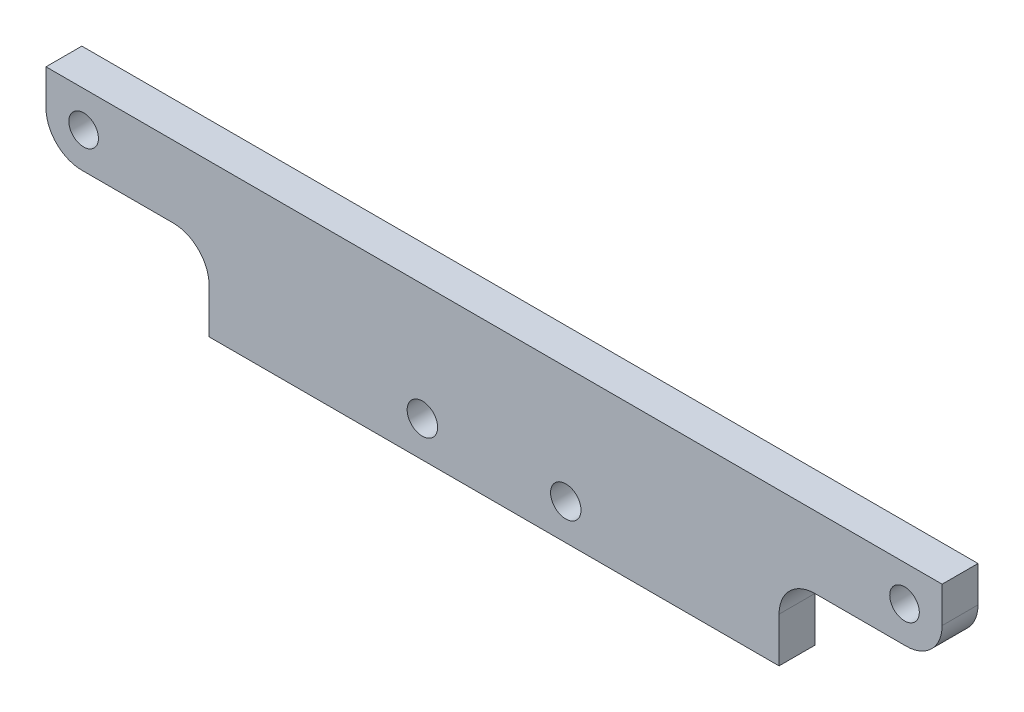
ISO-10303-21;
HEADER;
FILE_DESCRIPTION(('STEP AP214'),'2;1');
FILE_NAME('part.step','',(''),(''),'','','');
FILE_SCHEMA(('AUTOMOTIVE_DESIGN { 1 0 10303 214 1 1 1 1 }'));
ENDSEC;
DATA;
#1=APPLICATION_CONTEXT('core data for automotive mechanical design processes');
#2=APPLICATION_PROTOCOL_DEFINITION('international standard','automotive_design',2000,#1);
#3=PRODUCT_CONTEXT('',#1,'mechanical');
#4=PRODUCT('Part','Part','',(#3));
#5=PRODUCT_RELATED_PRODUCT_CATEGORY('part','',(#4));
#6=PRODUCT_DEFINITION_FORMATION('','',#4);
#7=PRODUCT_DEFINITION_CONTEXT('part definition',#1,'design');
#8=PRODUCT_DEFINITION('design','',#6,#7);
#9=PRODUCT_DEFINITION_SHAPE('','',#8);
#10=(LENGTH_UNIT() NAMED_UNIT(*) SI_UNIT(.MILLI.,.METRE.));
#11=(NAMED_UNIT(*) PLANE_ANGLE_UNIT() SI_UNIT($,.RADIAN.));
#12=(NAMED_UNIT(*) SI_UNIT($,.STERADIAN.) SOLID_ANGLE_UNIT());
#13=UNCERTAINTY_MEASURE_WITH_UNIT(LENGTH_MEASURE(1.E-05),#10,'distance_accuracy_value','');
#14=(GEOMETRIC_REPRESENTATION_CONTEXT(3) GLOBAL_UNCERTAINTY_ASSIGNED_CONTEXT((#13)) GLOBAL_UNIT_ASSIGNED_CONTEXT((#10,
#11,#12)) REPRESENTATION_CONTEXT('',''));
#15=CARTESIAN_POINT('',(0.,0.,0.));
#16=DIRECTION('',(0.,0.,1.));
#17=DIRECTION('',(1.,0.,0.));
#18=AXIS2_PLACEMENT_3D('',#15,#16,#17);
#19=CARTESIAN_POINT('',(-50.,0.,2.));
#20=DIRECTION('',(1.,0.,0.));
#21=DIRECTION('',(0.,0.,-1.));
#22=AXIS2_PLACEMENT_3D('',#19,#20,#21);
#23=PLANE('',#22);
#24=DIRECTION('',(0.,-1.,0.));
#25=VECTOR('',#24,1.);
#26=CARTESIAN_POINT('',(-50.,0.,-2.));
#27=LINE('',#26,#25);
#28=CARTESIAN_POINT('',(-50.,17.,-2.));
#29=VERTEX_POINT('',#28);
#30=CARTESIAN_POINT('',(-50.,13.,-2.));
#31=VERTEX_POINT('',#30);
#32=EDGE_CURVE('E153',#29,#31,#27,.T.);
#33=ORIENTED_EDGE('',*,*,#32,.T.);
#34=DIRECTION('',(0.,0.,-1.));
#35=VECTOR('',#34,1.);
#36=CARTESIAN_POINT('',(-50.,13.,2.));
#37=LINE('',#36,#35);
#38=CARTESIAN_POINT('',(-50.,13.,2.));
#39=VERTEX_POINT('',#38);
#40=EDGE_CURVE('E180',#31,#39,#37,.F.);
#41=ORIENTED_EDGE('',*,*,#40,.T.);
#42=DIRECTION('',(0.,-1.,0.));
#43=VECTOR('',#42,1.);
#44=CARTESIAN_POINT('',(-50.,0.,2.));
#45=LINE('',#44,#43);
#46=CARTESIAN_POINT('',(-50.,17.,2.));
#47=VERTEX_POINT('',#46);
#48=EDGE_CURVE('E163',#47,#39,#45,.T.);
#49=ORIENTED_EDGE('',*,*,#48,.F.);
#50=DIRECTION('',(0.,0.,-1.));
#51=VECTOR('',#50,1.);
#52=CARTESIAN_POINT('',(-50.,17.,2.));
#53=LINE('',#52,#51);
#54=EDGE_CURVE('E164',#47,#29,#53,.T.);
#55=ORIENTED_EDGE('',*,*,#54,.T.);
#56=EDGE_LOOP('',(#33,#41,#49,#55));
#57=FACE_BOUND('',#56,.T.);
#58=ADVANCED_FACE('F36',(#57),#23,.F.);
#59=CARTESIAN_POINT('',(50.,0.,2.));
#60=DIRECTION('',(0.,1.,0.));
#61=DIRECTION('',(-1.,0.,0.));
#62=AXIS2_PLACEMENT_3D('',#59,#60,#61);
#63=PLANE('',#62);
#64=DIRECTION('',(1.,0.,0.));
#65=VECTOR('',#64,1.);
#66=CARTESIAN_POINT('',(50.,0.,-2.));
#67=LINE('',#66,#65);
#68=CARTESIAN_POINT('',(-31.8,0.,-2.));
#69=VERTEX_POINT('',#68);
#70=CARTESIAN_POINT('',(31.8,0.,-2.));
#71=VERTEX_POINT('',#70);
#72=EDGE_CURVE('E145',#69,#71,#67,.T.);
#73=ORIENTED_EDGE('',*,*,#72,.T.);
#74=DIRECTION('',(0.,0.,-1.));
#75=VECTOR('',#74,1.);
#76=CARTESIAN_POINT('',(31.8,0.,8.));
#77=LINE('',#76,#75);
#78=CARTESIAN_POINT('',(31.8,0.,2.));
#79=VERTEX_POINT('',#78);
#80=EDGE_CURVE('E126',#79,#71,#77,.T.);
#81=ORIENTED_EDGE('',*,*,#80,.F.);
#82=DIRECTION('',(1.,0.,0.));
#83=VECTOR('',#82,1.);
#84=CARTESIAN_POINT('',(50.,0.,2.));
#85=LINE('',#84,#83);
#86=CARTESIAN_POINT('',(-31.8,0.,2.));
#87=VERTEX_POINT('',#86);
#88=EDGE_CURVE('E246',#87,#79,#85,.T.);
#89=ORIENTED_EDGE('',*,*,#88,.F.);
#90=DIRECTION('',(0.,0.,-1.));
#91=VECTOR('',#90,1.);
#92=CARTESIAN_POINT('',(-31.8,0.,8.));
#93=LINE('',#92,#91);
#94=EDGE_CURVE('E151',#87,#69,#93,.T.);
#95=ORIENTED_EDGE('',*,*,#94,.T.);
#96=EDGE_LOOP('',(#73,#81,#89,#95));
#97=FACE_BOUND('',#96,.T.);
#98=ADVANCED_FACE('F150',(#97),#63,.F.);
#99=CARTESIAN_POINT('',(0.,0.,2.));
#100=DIRECTION('',(0.,0.,-1.));
#101=DIRECTION('',(-1.,0.,0.));
#102=AXIS2_PLACEMENT_3D('',#99,#100,#101);
#103=PLANE('',#102);
#104=CARTESIAN_POINT('',(8.,3.99999999999999,2.));
#105=DIRECTION('',(0.,0.,-1.));
#106=DIRECTION('',(-1.,0.,0.));
#107=AXIS2_PLACEMENT_3D('',#104,#105,#106);
#108=CIRCLE('',#107,1.7);
#109=CARTESIAN_POINT('',(6.3,3.99999999999999,2.));
#110=VERTEX_POINT('',#109);
#111=EDGE_CURVE('E158',#110,#110,#108,.T.);
#112=ORIENTED_EDGE('',*,*,#111,.T.);
#113=EDGE_LOOP('',(#112));
#114=FACE_BOUND('',#113,.T.);
#115=CARTESIAN_POINT('',(-8.,3.99999999999999,2.));
#116=DIRECTION('',(0.,0.,-1.));
#117=DIRECTION('',(-1.,0.,0.));
#118=AXIS2_PLACEMENT_3D('',#115,#116,#117);
#119=CIRCLE('',#118,1.7);
#120=CARTESIAN_POINT('',(-9.7,3.99999999999999,2.));
#121=VERTEX_POINT('',#120);
#122=EDGE_CURVE('E236',#121,#121,#119,.T.);
#123=ORIENTED_EDGE('',*,*,#122,.T.);
#124=EDGE_LOOP('',(#123));
#125=FACE_BOUND('',#124,.T.);
#126=CARTESIAN_POINT('',(-45.8,13.,2.));
#127=DIRECTION('',(0.,0.,-1.));
#128=DIRECTION('',(-1.,0.,0.));
#129=AXIS2_PLACEMENT_3D('',#126,#127,#128);
#130=CIRCLE('',#129,1.65);
#131=CARTESIAN_POINT('',(-47.45,13.,2.));
#132=VERTEX_POINT('',#131);
#133=EDGE_CURVE('E230',#132,#132,#130,.T.);
#134=ORIENTED_EDGE('',*,*,#133,.T.);
#135=EDGE_LOOP('',(#134));
#136=FACE_BOUND('',#135,.T.);
#137=CARTESIAN_POINT('',(45.8,13.,2.));
#138=DIRECTION('',(0.,0.,-1.));
#139=DIRECTION('',(-1.,0.,0.));
#140=AXIS2_PLACEMENT_3D('',#137,#138,#139);
#141=CIRCLE('',#140,1.65);
#142=CARTESIAN_POINT('',(44.15,13.,2.));
#143=VERTEX_POINT('',#142);
#144=EDGE_CURVE('E224',#143,#143,#141,.T.);
#145=ORIENTED_EDGE('',*,*,#144,.T.);
#146=EDGE_LOOP('',(#145));
#147=FACE_BOUND('',#146,.T.);
#148=ORIENTED_EDGE('',*,*,#48,.T.);
#149=CARTESIAN_POINT('',(-46.,13.,2.));
#150=DIRECTION('',(0.,0.,-1.));
#151=DIRECTION('',(-1.,0.,0.));
#152=AXIS2_PLACEMENT_3D('',#149,#150,#151);
#153=CIRCLE('',#152,4.);
#154=CARTESIAN_POINT('',(-46.,9.00000000000003,2.));
#155=VERTEX_POINT('',#154);
#156=EDGE_CURVE('E183',#39,#155,#153,.F.);
#157=ORIENTED_EDGE('',*,*,#156,.T.);
#158=DIRECTION('',(-1.,0.,0.));
#159=VECTOR('',#158,1.);
#160=CARTESIAN_POINT('',(0.,9.00000000000002,2.));
#161=LINE('',#160,#159);
#162=CARTESIAN_POINT('',(-35.8,9.00000000000003,2.));
#163=VERTEX_POINT('',#162);
#164=EDGE_CURVE('E215',#163,#155,#161,.T.);
#165=ORIENTED_EDGE('',*,*,#164,.F.);
#166=CARTESIAN_POINT('',(-35.8,5.00000000000003,2.));
#167=DIRECTION('',(0.,0.,-1.));
#168=DIRECTION('',(-1.,0.,0.));
#169=AXIS2_PLACEMENT_3D('',#166,#167,#168);
#170=CIRCLE('',#169,4.);
#171=CARTESIAN_POINT('',(-31.8,5.00000000000003,2.));
#172=VERTEX_POINT('',#171);
#173=EDGE_CURVE('E51',#163,#172,#170,.T.);
#174=ORIENTED_EDGE('',*,*,#173,.T.);
#175=DIRECTION('',(0.,1.,0.));
#176=VECTOR('',#175,1.);
#177=CARTESIAN_POINT('',(-31.8,0.,2.));
#178=LINE('',#177,#176);
#179=EDGE_CURVE('E214',#87,#172,#178,.T.);
#180=ORIENTED_EDGE('',*,*,#179,.F.);
#181=ORIENTED_EDGE('',*,*,#88,.T.);
#182=DIRECTION('',(0.,1.,0.));
#183=VECTOR('',#182,1.);
#184=CARTESIAN_POINT('',(31.8,0.,2.));
#185=LINE('',#184,#183);
#186=CARTESIAN_POINT('',(31.8,5.00000000000002,2.));
#187=VERTEX_POINT('',#186);
#188=EDGE_CURVE('E132',#79,#187,#185,.T.);
#189=ORIENTED_EDGE('',*,*,#188,.T.);
#190=CARTESIAN_POINT('',(35.8,5.00000000000002,2.));
#191=DIRECTION('',(0.,0.,-1.));
#192=DIRECTION('',(-1.,0.,0.));
#193=AXIS2_PLACEMENT_3D('',#190,#191,#192);
#194=CIRCLE('',#193,4.);
#195=CARTESIAN_POINT('',(35.8,9.00000000000002,2.));
#196=VERTEX_POINT('',#195);
#197=EDGE_CURVE('E11',#187,#196,#194,.T.);
#198=ORIENTED_EDGE('',*,*,#197,.T.);
#199=DIRECTION('',(1.,0.,0.));
#200=VECTOR('',#199,1.);
#201=CARTESIAN_POINT('',(0.,9.00000000000002,2.));
#202=LINE('',#201,#200);
#203=CARTESIAN_POINT('',(46.,9.00000000000002,2.));
#204=VERTEX_POINT('',#203);
#205=EDGE_CURVE('E147',#196,#204,#202,.T.);
#206=ORIENTED_EDGE('',*,*,#205,.T.);
#207=CARTESIAN_POINT('',(46.,13.,2.));
#208=DIRECTION('',(0.,0.,-1.));
#209=DIRECTION('',(-1.,0.,0.));
#210=AXIS2_PLACEMENT_3D('',#207,#208,#209);
#211=CIRCLE('',#210,4.);
#212=CARTESIAN_POINT('',(50.,13.,2.));
#213=VERTEX_POINT('',#212);
#214=EDGE_CURVE('E58',#204,#213,#211,.F.);
#215=ORIENTED_EDGE('',*,*,#214,.T.);
#216=DIRECTION('',(0.,1.,0.));
#217=VECTOR('',#216,1.);
#218=CARTESIAN_POINT('',(50.,17.,2.));
#219=LINE('',#218,#217);
#220=CARTESIAN_POINT('',(50.,17.,2.));
#221=VERTEX_POINT('',#220);
#222=EDGE_CURVE('E248',#213,#221,#219,.T.);
#223=ORIENTED_EDGE('',*,*,#222,.T.);
#224=DIRECTION('',(-1.,0.,0.));
#225=VECTOR('',#224,1.);
#226=CARTESIAN_POINT('',(-50.,17.,2.));
#227=LINE('',#226,#225);
#228=EDGE_CURVE('E168',#221,#47,#227,.T.);
#229=ORIENTED_EDGE('',*,*,#228,.T.);
#230=EDGE_LOOP('',(#148,#157,#165,#174,#180,#181,#189,#198,#206,#215,#223,#229));
#231=FACE_BOUND('',#230,.T.);
#232=ADVANCED_FACE('F251',(#114,#125,#136,#147,#231),#103,.F.);
#233=CARTESIAN_POINT('',(0.,0.,-2.));
#234=DIRECTION('',(0.,0.,-1.));
#235=DIRECTION('',(-1.,0.,0.));
#236=AXIS2_PLACEMENT_3D('',#233,#234,#235);
#237=PLANE('',#236);
#238=DIRECTION('',(-1.,0.,0.));
#239=VECTOR('',#238,1.);
#240=CARTESIAN_POINT('',(0.,9.00000000000002,-2.));
#241=LINE('',#240,#239);
#242=CARTESIAN_POINT('',(-35.8,9.00000000000003,-2.));
#243=VERTEX_POINT('',#242);
#244=CARTESIAN_POINT('',(-46.,9.00000000000003,-2.));
#245=VERTEX_POINT('',#244);
#246=EDGE_CURVE('E201',#243,#245,#241,.T.);
#247=ORIENTED_EDGE('',*,*,#246,.T.);
#248=CARTESIAN_POINT('',(-46.,13.,-2.));
#249=DIRECTION('',(0.,0.,-1.));
#250=DIRECTION('',(-1.,0.,0.));
#251=AXIS2_PLACEMENT_3D('',#248,#249,#250);
#252=CIRCLE('',#251,4.);
#253=EDGE_CURVE('E178',#245,#31,#252,.T.);
#254=ORIENTED_EDGE('',*,*,#253,.T.);
#255=ORIENTED_EDGE('',*,*,#32,.F.);
#256=DIRECTION('',(-1.,0.,0.));
#257=VECTOR('',#256,1.);
#258=CARTESIAN_POINT('',(-50.,17.,-2.));
#259=LINE('',#258,#257);
#260=CARTESIAN_POINT('',(50.,17.,-2.));
#261=VERTEX_POINT('',#260);
#262=EDGE_CURVE('E155',#261,#29,#259,.T.);
#263=ORIENTED_EDGE('',*,*,#262,.F.);
#264=DIRECTION('',(0.,1.,0.));
#265=VECTOR('',#264,1.);
#266=CARTESIAN_POINT('',(50.,17.,-2.));
#267=LINE('',#266,#265);
#268=CARTESIAN_POINT('',(50.,13.,-2.));
#269=VERTEX_POINT('',#268);
#270=EDGE_CURVE('E152',#269,#261,#267,.T.);
#271=ORIENTED_EDGE('',*,*,#270,.F.);
#272=CARTESIAN_POINT('',(46.,13.,-2.));
#273=DIRECTION('',(0.,0.,-1.));
#274=DIRECTION('',(-1.,0.,0.));
#275=AXIS2_PLACEMENT_3D('',#272,#273,#274);
#276=CIRCLE('',#275,4.);
#277=CARTESIAN_POINT('',(46.,9.00000000000002,-2.));
#278=VERTEX_POINT('',#277);
#279=EDGE_CURVE('E176',#269,#278,#276,.T.);
#280=ORIENTED_EDGE('',*,*,#279,.T.);
#281=DIRECTION('',(1.,0.,0.));
#282=VECTOR('',#281,1.);
#283=CARTESIAN_POINT('',(31.8,9.00000000000002,-2.));
#284=LINE('',#283,#282);
#285=CARTESIAN_POINT('',(35.8,9.00000000000002,-2.));
#286=VERTEX_POINT('',#285);
#287=EDGE_CURVE('E137',#286,#278,#284,.T.);
#288=ORIENTED_EDGE('',*,*,#287,.F.);
#289=CARTESIAN_POINT('',(35.8,5.00000000000002,-2.));
#290=DIRECTION('',(0.,0.,-1.));
#291=DIRECTION('',(-1.,0.,0.));
#292=AXIS2_PLACEMENT_3D('',#289,#290,#291);
#293=CIRCLE('',#292,4.);
#294=CARTESIAN_POINT('',(31.8,5.00000000000002,-2.));
#295=VERTEX_POINT('',#294);
#296=EDGE_CURVE('E44',#286,#295,#293,.F.);
#297=ORIENTED_EDGE('',*,*,#296,.T.);
#298=DIRECTION('',(0.,1.,0.));
#299=VECTOR('',#298,1.);
#300=CARTESIAN_POINT('',(31.8,0.,-2.));
#301=LINE('',#300,#299);
#302=EDGE_CURVE('E129',#71,#295,#301,.T.);
#303=ORIENTED_EDGE('',*,*,#302,.F.);
#304=ORIENTED_EDGE('',*,*,#72,.F.);
#305=DIRECTION('',(0.,1.,0.));
#306=VECTOR('',#305,1.);
#307=CARTESIAN_POINT('',(-31.8,0.,-2.));
#308=LINE('',#307,#306);
#309=CARTESIAN_POINT('',(-31.8,5.00000000000003,-2.));
#310=VERTEX_POINT('',#309);
#311=EDGE_CURVE('E202',#69,#310,#308,.T.);
#312=ORIENTED_EDGE('',*,*,#311,.T.);
#313=CARTESIAN_POINT('',(-35.8,5.00000000000003,-2.));
#314=DIRECTION('',(0.,0.,-1.));
#315=DIRECTION('',(-1.,0.,0.));
#316=AXIS2_PLACEMENT_3D('',#313,#314,#315);
#317=CIRCLE('',#316,4.);
#318=EDGE_CURVE('E198',#310,#243,#317,.F.);
#319=ORIENTED_EDGE('',*,*,#318,.T.);
#320=EDGE_LOOP('',(#247,#254,#255,#263,#271,#280,#288,#297,#303,#304,#312,#319));
#321=FACE_BOUND('',#320,.T.);
#322=CARTESIAN_POINT('',(45.8,13.,-2.));
#323=DIRECTION('',(0.,0.,-1.));
#324=DIRECTION('',(-1.,0.,0.));
#325=AXIS2_PLACEMENT_3D('',#322,#323,#324);
#326=CIRCLE('',#325,1.65);
#327=CARTESIAN_POINT('',(44.15,13.,-2.));
#328=VERTEX_POINT('',#327);
#329=EDGE_CURVE('E217',#328,#328,#326,.T.);
#330=ORIENTED_EDGE('',*,*,#329,.F.);
#331=EDGE_LOOP('',(#330));
#332=FACE_BOUND('',#331,.T.);
#333=CARTESIAN_POINT('',(-45.8,13.,-2.));
#334=DIRECTION('',(0.,0.,-1.));
#335=DIRECTION('',(-1.,0.,0.));
#336=AXIS2_PLACEMENT_3D('',#333,#334,#335);
#337=CIRCLE('',#336,1.65);
#338=CARTESIAN_POINT('',(-47.45,13.,-2.));
#339=VERTEX_POINT('',#338);
#340=EDGE_CURVE('E227',#339,#339,#337,.T.);
#341=ORIENTED_EDGE('',*,*,#340,.F.);
#342=EDGE_LOOP('',(#341));
#343=FACE_BOUND('',#342,.T.);
#344=CARTESIAN_POINT('',(-8.,3.99999999999999,-2.));
#345=DIRECTION('',(0.,0.,-1.));
#346=DIRECTION('',(-1.,0.,0.));
#347=AXIS2_PLACEMENT_3D('',#344,#345,#346);
#348=CIRCLE('',#347,1.69999999999999);
#349=CARTESIAN_POINT('',(-9.69999999999999,3.99999999999999,-2.));
#350=VERTEX_POINT('',#349);
#351=EDGE_CURVE('E233',#350,#350,#348,.T.);
#352=ORIENTED_EDGE('',*,*,#351,.F.);
#353=EDGE_LOOP('',(#352));
#354=FACE_BOUND('',#353,.T.);
#355=CARTESIAN_POINT('',(8.,3.99999999999999,-2.));
#356=DIRECTION('',(0.,0.,-1.));
#357=DIRECTION('',(-1.,0.,0.));
#358=AXIS2_PLACEMENT_3D('',#355,#356,#357);
#359=CIRCLE('',#358,1.69999999999999);
#360=CARTESIAN_POINT('',(6.30000000000001,3.99999999999999,-2.));
#361=VERTEX_POINT('',#360);
#362=EDGE_CURVE('E239',#361,#361,#359,.T.);
#363=ORIENTED_EDGE('',*,*,#362,.F.);
#364=EDGE_LOOP('',(#363));
#365=FACE_BOUND('',#364,.T.);
#366=ADVANCED_FACE('F142',(#321,#332,#343,#354,#365),#237,.T.);
#367=CARTESIAN_POINT('',(50.,17.,2.));
#368=DIRECTION('',(-1.,0.,0.));
#369=DIRECTION('',(0.,-1.,0.));
#370=AXIS2_PLACEMENT_3D('',#367,#368,#369);
#371=PLANE('',#370);
#372=ORIENTED_EDGE('',*,*,#222,.F.);
#373=DIRECTION('',(0.,0.,-1.));
#374=VECTOR('',#373,1.);
#375=CARTESIAN_POINT('',(50.,13.,2.));
#376=LINE('',#375,#374);
#377=EDGE_CURVE('E188',#213,#269,#376,.T.);
#378=ORIENTED_EDGE('',*,*,#377,.T.);
#379=ORIENTED_EDGE('',*,*,#270,.T.);
#380=DIRECTION('',(0.,0.,-1.));
#381=VECTOR('',#380,1.);
#382=CARTESIAN_POINT('',(50.,17.,2.));
#383=LINE('',#382,#381);
#384=EDGE_CURVE('E167',#221,#261,#383,.T.);
#385=ORIENTED_EDGE('',*,*,#384,.F.);
#386=EDGE_LOOP('',(#372,#378,#379,#385));
#387=FACE_BOUND('',#386,.T.);
#388=ADVANCED_FACE('F266',(#387),#371,.F.);
#389=CARTESIAN_POINT('',(-50.,17.,2.));
#390=DIRECTION('',(0.,-1.,0.));
#391=DIRECTION('',(1.,0.,0.));
#392=AXIS2_PLACEMENT_3D('',#389,#390,#391);
#393=PLANE('',#392);
#394=ORIENTED_EDGE('',*,*,#262,.T.);
#395=ORIENTED_EDGE('',*,*,#54,.F.);
#396=ORIENTED_EDGE('',*,*,#228,.F.);
#397=ORIENTED_EDGE('',*,*,#384,.T.);
#398=EDGE_LOOP('',(#394,#395,#396,#397));
#399=FACE_BOUND('',#398,.T.);
#400=ADVANCED_FACE('F256',(#399),#393,.F.);
#401=CARTESIAN_POINT('',(8.,3.99999999999999,-2.));
#402=DIRECTION('',(0.,0.,-1.));
#403=DIRECTION('',(-1.,0.,0.));
#404=AXIS2_PLACEMENT_3D('',#401,#402,#403);
#405=CYLINDRICAL_SURFACE('',#404,1.69999999999999);
#406=ORIENTED_EDGE('',*,*,#111,.F.);
#407=EDGE_LOOP('',(#406));
#408=FACE_BOUND('',#407,.T.);
#409=ORIENTED_EDGE('',*,*,#362,.T.);
#410=EDGE_LOOP('',(#409));
#411=FACE_BOUND('',#410,.T.);
#412=ADVANCED_FACE('F395',(#408,#411),#405,.F.);
#413=CARTESIAN_POINT('',(-8.,3.99999999999999,-2.));
#414=DIRECTION('',(0.,0.,-1.));
#415=DIRECTION('',(-1.,0.,0.));
#416=AXIS2_PLACEMENT_3D('',#413,#414,#415);
#417=CYLINDRICAL_SURFACE('',#416,1.69999999999999);
#418=ORIENTED_EDGE('',*,*,#122,.F.);
#419=EDGE_LOOP('',(#418));
#420=FACE_BOUND('',#419,.T.);
#421=ORIENTED_EDGE('',*,*,#351,.T.);
#422=EDGE_LOOP('',(#421));
#423=FACE_BOUND('',#422,.T.);
#424=ADVANCED_FACE('F386',(#420,#423),#417,.F.);
#425=CARTESIAN_POINT('',(-45.8,13.,-2.));
#426=DIRECTION('',(0.,0.,-1.));
#427=DIRECTION('',(-1.,0.,0.));
#428=AXIS2_PLACEMENT_3D('',#425,#426,#427);
#429=CYLINDRICAL_SURFACE('',#428,1.65);
#430=ORIENTED_EDGE('',*,*,#133,.F.);
#431=EDGE_LOOP('',(#430));
#432=FACE_BOUND('',#431,.T.);
#433=ORIENTED_EDGE('',*,*,#340,.T.);
#434=EDGE_LOOP('',(#433));
#435=FACE_BOUND('',#434,.T.);
#436=ADVANCED_FACE('F377',(#432,#435),#429,.F.);
#437=CARTESIAN_POINT('',(45.8,13.,-2.));
#438=DIRECTION('',(0.,0.,-1.));
#439=DIRECTION('',(-1.,0.,0.));
#440=AXIS2_PLACEMENT_3D('',#437,#438,#439);
#441=CYLINDRICAL_SURFACE('',#440,1.65);
#442=ORIENTED_EDGE('',*,*,#144,.F.);
#443=EDGE_LOOP('',(#442));
#444=FACE_BOUND('',#443,.T.);
#445=ORIENTED_EDGE('',*,*,#329,.T.);
#446=EDGE_LOOP('',(#445));
#447=FACE_BOUND('',#446,.T.);
#448=ADVANCED_FACE('F344',(#444,#447),#441,.F.);
#449=CARTESIAN_POINT('',(0.,9.00000000000002,8.));
#450=DIRECTION('',(0.,-1.,0.));
#451=DIRECTION('',(1.,0.,0.));
#452=AXIS2_PLACEMENT_3D('',#449,#450,#451);
#453=PLANE('',#452);
#454=ORIENTED_EDGE('',*,*,#164,.T.);
#455=DIRECTION('',(0.,0.,-1.));
#456=VECTOR('',#455,1.);
#457=CARTESIAN_POINT('',(-46.,9.00000000000003,-2.));
#458=LINE('',#457,#456);
#459=EDGE_CURVE('E173',#155,#245,#458,.T.);
#460=ORIENTED_EDGE('',*,*,#459,.T.);
#461=ORIENTED_EDGE('',*,*,#246,.F.);
#462=DIRECTION('',(0.,0.,-1.));
#463=VECTOR('',#462,1.);
#464=CARTESIAN_POINT('',(-35.8,9.00000000000003,2.));
#465=LINE('',#464,#463);
#466=EDGE_CURVE('E171',#243,#163,#465,.F.);
#467=ORIENTED_EDGE('',*,*,#466,.T.);
#468=EDGE_LOOP('',(#454,#460,#461,#467));
#469=FACE_BOUND('',#468,.T.);
#470=ADVANCED_FACE('F208',(#469),#453,.T.);
#471=CARTESIAN_POINT('',(-31.8,0.,8.));
#472=DIRECTION('',(-1.,0.,0.));
#473=DIRECTION('',(0.,0.,1.));
#474=AXIS2_PLACEMENT_3D('',#471,#472,#473);
#475=PLANE('',#474);
#476=ORIENTED_EDGE('',*,*,#179,.T.);
#477=DIRECTION('',(0.,0.,-1.));
#478=VECTOR('',#477,1.);
#479=CARTESIAN_POINT('',(-31.8,5.00000000000003,-2.));
#480=LINE('',#479,#478);
#481=EDGE_CURVE('E185',#172,#310,#480,.T.);
#482=ORIENTED_EDGE('',*,*,#481,.T.);
#483=ORIENTED_EDGE('',*,*,#311,.F.);
#484=ORIENTED_EDGE('',*,*,#94,.F.);
#485=EDGE_LOOP('',(#476,#482,#483,#484));
#486=FACE_BOUND('',#485,.T.);
#487=ADVANCED_FACE('F213',(#486),#475,.T.);
#488=CARTESIAN_POINT('',(31.8,0.,8.));
#489=DIRECTION('',(-1.,0.,0.));
#490=DIRECTION('',(0.,0.,1.));
#491=AXIS2_PLACEMENT_3D('',#488,#489,#490);
#492=PLANE('',#491);
#493=ORIENTED_EDGE('',*,*,#302,.T.);
#494=DIRECTION('',(0.,0.,-1.));
#495=VECTOR('',#494,1.);
#496=CARTESIAN_POINT('',(31.8,5.00000000000002,2.));
#497=LINE('',#496,#495);
#498=EDGE_CURVE('E196',#295,#187,#497,.F.);
#499=ORIENTED_EDGE('',*,*,#498,.T.);
#500=ORIENTED_EDGE('',*,*,#188,.F.);
#501=ORIENTED_EDGE('',*,*,#80,.T.);
#502=EDGE_LOOP('',(#493,#499,#500,#501));
#503=FACE_BOUND('',#502,.T.);
#504=ADVANCED_FACE('F128',(#503),#492,.F.);
#505=CARTESIAN_POINT('',(31.8,9.00000000000002,8.));
#506=DIRECTION('',(0.,1.,0.));
#507=DIRECTION('',(-1.,0.,0.));
#508=AXIS2_PLACEMENT_3D('',#505,#506,#507);
#509=PLANE('',#508);
#510=ORIENTED_EDGE('',*,*,#287,.T.);
#511=DIRECTION('',(0.,0.,-1.));
#512=VECTOR('',#511,1.);
#513=CARTESIAN_POINT('',(46.,9.00000000000002,8.));
#514=LINE('',#513,#512);
#515=EDGE_CURVE('E194',#278,#204,#514,.F.);
#516=ORIENTED_EDGE('',*,*,#515,.T.);
#517=ORIENTED_EDGE('',*,*,#205,.F.);
#518=DIRECTION('',(0.,0.,-1.));
#519=VECTOR('',#518,1.);
#520=CARTESIAN_POINT('',(35.8,9.00000000000002,-2.));
#521=LINE('',#520,#519);
#522=EDGE_CURVE('E191',#196,#286,#521,.T.);
#523=ORIENTED_EDGE('',*,*,#522,.T.);
#524=EDGE_LOOP('',(#510,#516,#517,#523));
#525=FACE_BOUND('',#524,.T.);
#526=ADVANCED_FACE('F273',(#525),#509,.F.);
#527=CARTESIAN_POINT('',(-46.,13.,8.));
#528=DIRECTION('',(0.,0.,1.));
#529=DIRECTION('',(1.,0.,0.));
#530=AXIS2_PLACEMENT_3D('',#527,#528,#529);
#531=CYLINDRICAL_SURFACE('',#530,4.);
#532=ORIENTED_EDGE('',*,*,#156,.F.);
#533=ORIENTED_EDGE('',*,*,#40,.F.);
#534=ORIENTED_EDGE('',*,*,#253,.F.);
#535=ORIENTED_EDGE('',*,*,#459,.F.);
#536=EDGE_LOOP('',(#532,#533,#534,#535));
#537=FACE_BOUND('',#536,.T.);
#538=ADVANCED_FACE('F262',(#537),#531,.T.);
#539=CARTESIAN_POINT('',(-35.8,5.00000000000003,8.));
#540=DIRECTION('',(0.,0.,1.));
#541=DIRECTION('',(1.,0.,0.));
#542=AXIS2_PLACEMENT_3D('',#539,#540,#541);
#543=CYLINDRICAL_SURFACE('',#542,4.);
#544=ORIENTED_EDGE('',*,*,#173,.F.);
#545=ORIENTED_EDGE('',*,*,#466,.F.);
#546=ORIENTED_EDGE('',*,*,#318,.F.);
#547=ORIENTED_EDGE('',*,*,#481,.F.);
#548=EDGE_LOOP('',(#544,#545,#546,#547));
#549=FACE_BOUND('',#548,.T.);
#550=ADVANCED_FACE('F211',(#549),#543,.F.);
#551=CARTESIAN_POINT('',(46.,13.,2.));
#552=DIRECTION('',(0.,0.,-1.));
#553=DIRECTION('',(-1.,0.,0.));
#554=AXIS2_PLACEMENT_3D('',#551,#552,#553);
#555=CYLINDRICAL_SURFACE('',#554,4.);
#556=ORIENTED_EDGE('',*,*,#214,.F.);
#557=ORIENTED_EDGE('',*,*,#515,.F.);
#558=ORIENTED_EDGE('',*,*,#279,.F.);
#559=ORIENTED_EDGE('',*,*,#377,.F.);
#560=EDGE_LOOP('',(#556,#557,#558,#559));
#561=FACE_BOUND('',#560,.T.);
#562=ADVANCED_FACE('F269',(#561),#555,.T.);
#563=CARTESIAN_POINT('',(35.8,5.00000000000002,8.));
#564=DIRECTION('',(0.,0.,1.));
#565=DIRECTION('',(1.,0.,0.));
#566=AXIS2_PLACEMENT_3D('',#563,#564,#565);
#567=CYLINDRICAL_SURFACE('',#566,4.);
#568=ORIENTED_EDGE('',*,*,#197,.F.);
#569=ORIENTED_EDGE('',*,*,#498,.F.);
#570=ORIENTED_EDGE('',*,*,#296,.F.);
#571=ORIENTED_EDGE('',*,*,#522,.F.);
#572=EDGE_LOOP('',(#568,#569,#570,#571));
#573=FACE_BOUND('',#572,.T.);
#574=ADVANCED_FACE('F38',(#573),#567,.F.);
#575=CLOSED_SHELL('',(#58,#98,#232,#366,#388,#400,#412,#424,#436,#448,#470,#487,#504,#526,#538,
#550,#562,#574));
#576=MANIFOLD_SOLID_BREP('B2',#575);
#577=ADVANCED_BREP_SHAPE_REPRESENTATION('',(#18,#576),#14);
#578=SHAPE_DEFINITION_REPRESENTATION(#9,#577);
ENDSEC;
END-ISO-10303-21;
